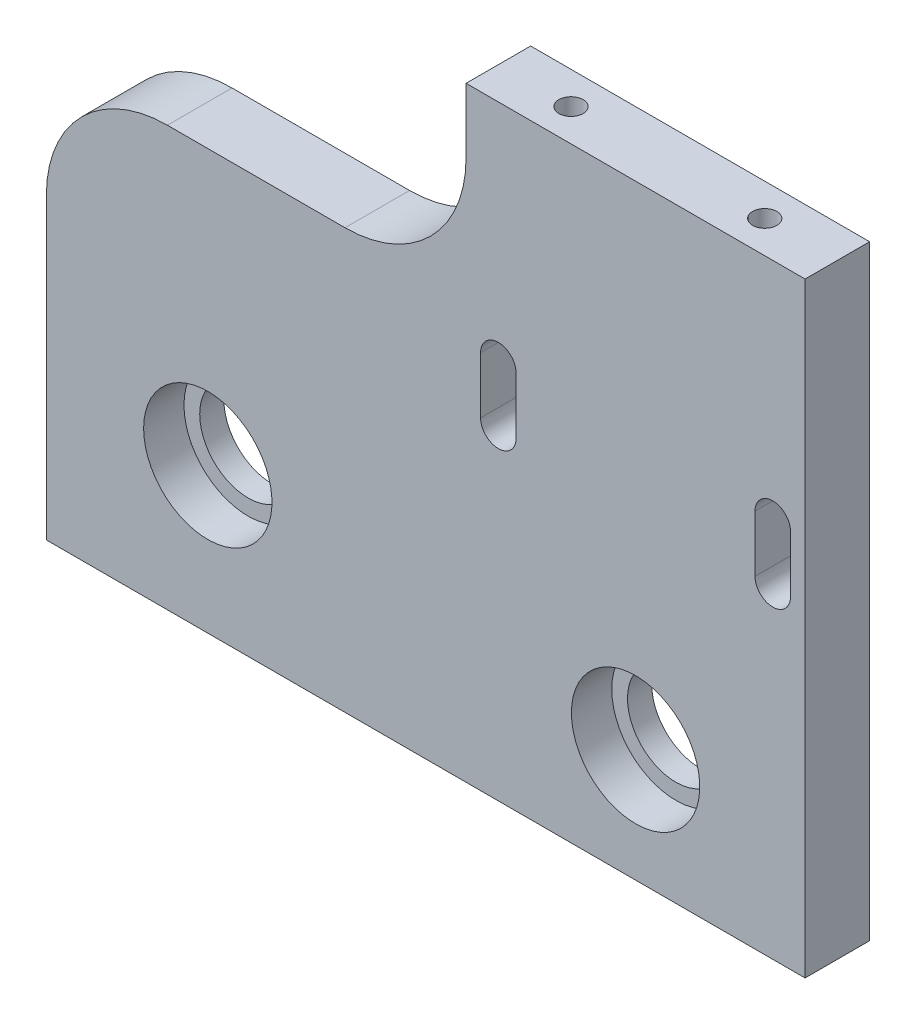
ISO-10303-21;
HEADER;
FILE_DESCRIPTION(('STEP AP214'),'2;1');
FILE_NAME('part.step','',(''),(''),'','','');
FILE_SCHEMA(('AUTOMOTIVE_DESIGN { 1 0 10303 214 1 1 1 1 }'));
ENDSEC;
DATA;
#1=APPLICATION_CONTEXT('core data for automotive mechanical design processes');
#2=APPLICATION_PROTOCOL_DEFINITION('international standard','automotive_design',2000,#1);
#3=PRODUCT_CONTEXT('',#1,'mechanical');
#4=PRODUCT('Part','Part','',(#3));
#5=PRODUCT_RELATED_PRODUCT_CATEGORY('part','',(#4));
#6=PRODUCT_DEFINITION_FORMATION('','',#4);
#7=PRODUCT_DEFINITION_CONTEXT('part definition',#1,'design');
#8=PRODUCT_DEFINITION('design','',#6,#7);
#9=PRODUCT_DEFINITION_SHAPE('','',#8);
#10=(LENGTH_UNIT() NAMED_UNIT(*) SI_UNIT(.MILLI.,.METRE.));
#11=(NAMED_UNIT(*) PLANE_ANGLE_UNIT() SI_UNIT($,.RADIAN.));
#12=(NAMED_UNIT(*) SI_UNIT($,.STERADIAN.) SOLID_ANGLE_UNIT());
#13=UNCERTAINTY_MEASURE_WITH_UNIT(LENGTH_MEASURE(1.E-05),#10,'distance_accuracy_value','');
#14=(GEOMETRIC_REPRESENTATION_CONTEXT(3) GLOBAL_UNCERTAINTY_ASSIGNED_CONTEXT((#13)) GLOBAL_UNIT_ASSIGNED_CONTEXT((#10,
#11,#12)) REPRESENTATION_CONTEXT('',''));
#15=CARTESIAN_POINT('',(0.,0.,0.));
#16=DIRECTION('',(0.,0.,1.));
#17=DIRECTION('',(1.,0.,0.));
#18=AXIS2_PLACEMENT_3D('',#15,#16,#17);
#19=CARTESIAN_POINT('',(0.,0.,-8.));
#20=DIRECTION('',(1.,0.,0.));
#21=DIRECTION('',(0.,1.,0.));
#22=AXIS2_PLACEMENT_3D('',#19,#20,#21);
#23=PLANE('',#22);
#24=DIRECTION('',(0.,-1.,0.));
#25=VECTOR('',#24,1.);
#26=CARTESIAN_POINT('',(0.,0.,-8.));
#27=LINE('',#26,#25);
#28=CARTESIAN_POINT('',(0.,37.,-8.));
#29=VERTEX_POINT('',#28);
#30=CARTESIAN_POINT('',(0.,0.,-8.));
#31=VERTEX_POINT('',#30);
#32=EDGE_CURVE('E257',#29,#31,#27,.T.);
#33=ORIENTED_EDGE('',*,*,#32,.T.);
#34=DIRECTION('',(0.,0.,1.));
#35=VECTOR('',#34,1.);
#36=CARTESIAN_POINT('',(0.,0.,-8.));
#37=LINE('',#36,#35);
#38=CARTESIAN_POINT('',(0.,0.,0.));
#39=VERTEX_POINT('',#38);
#40=EDGE_CURVE('E301',#31,#39,#37,.T.);
#41=ORIENTED_EDGE('',*,*,#40,.T.);
#42=DIRECTION('',(0.,-1.,0.));
#43=VECTOR('',#42,1.);
#44=CARTESIAN_POINT('',(0.,0.,0.));
#45=LINE('',#44,#43);
#46=CARTESIAN_POINT('',(0.,37.,0.));
#47=VERTEX_POINT('',#46);
#48=EDGE_CURVE('E248',#47,#39,#45,.T.);
#49=ORIENTED_EDGE('',*,*,#48,.F.);
#50=DIRECTION('',(0.,0.,1.));
#51=VECTOR('',#50,1.);
#52=CARTESIAN_POINT('',(0.,37.,-8.));
#53=LINE('',#52,#51);
#54=EDGE_CURVE('E304',#29,#47,#53,.T.);
#55=ORIENTED_EDGE('',*,*,#54,.F.);
#56=EDGE_LOOP('',(#33,#41,#49,#55));
#57=FACE_BOUND('',#56,.T.);
#58=ADVANCED_FACE('F43',(#57),#23,.F.);
#59=CARTESIAN_POINT('',(0.,0.,-8.));
#60=DIRECTION('',(0.,1.,0.));
#61=DIRECTION('',(0.,0.,-1.));
#62=AXIS2_PLACEMENT_3D('',#59,#60,#61);
#63=PLANE('',#62);
#64=CARTESIAN_POINT('',(6.00000000000001,0.,-4.));
#65=DIRECTION('',(0.,1.,0.));
#66=DIRECTION('',(0.,0.,1.));
#67=AXIS2_PLACEMENT_3D('',#64,#65,#66);
#68=CIRCLE('',#67,1.5);
#69=CARTESIAN_POINT('',(6.00000000000001,0.,-2.5));
#70=VERTEX_POINT('',#69);
#71=EDGE_CURVE('E678',#70,#70,#68,.T.);
#72=ORIENTED_EDGE('',*,*,#71,.T.);
#73=EDGE_LOOP('',(#72));
#74=FACE_BOUND('',#73,.T.);
#75=CARTESIAN_POINT('',(88.,0.,-4.));
#76=DIRECTION('',(0.,1.,0.));
#77=DIRECTION('',(0.,0.,1.));
#78=AXIS2_PLACEMENT_3D('',#75,#76,#77);
#79=CIRCLE('',#78,1.5);
#80=CARTESIAN_POINT('',(88.,0.,-2.5));
#81=VERTEX_POINT('',#80);
#82=EDGE_CURVE('E687',#81,#81,#79,.T.);
#83=ORIENTED_EDGE('',*,*,#82,.T.);
#84=EDGE_LOOP('',(#83));
#85=FACE_BOUND('',#84,.T.);
#86=DIRECTION('',(1.,0.,0.));
#87=VECTOR('',#86,1.);
#88=CARTESIAN_POINT('',(0.,0.,0.));
#89=LINE('',#88,#87);
#90=CARTESIAN_POINT('',(94.,0.,0.));
#91=VERTEX_POINT('',#90);
#92=EDGE_CURVE('E279',#39,#91,#89,.T.);
#93=ORIENTED_EDGE('',*,*,#92,.F.);
#94=ORIENTED_EDGE('',*,*,#40,.F.);
#95=DIRECTION('',(1.,0.,0.));
#96=VECTOR('',#95,1.);
#97=CARTESIAN_POINT('',(0.,0.,-8.));
#98=LINE('',#97,#96);
#99=CARTESIAN_POINT('',(94.,0.,-8.));
#100=VERTEX_POINT('',#99);
#101=EDGE_CURVE('E260',#31,#100,#98,.T.);
#102=ORIENTED_EDGE('',*,*,#101,.T.);
#103=DIRECTION('',(0.,0.,1.));
#104=VECTOR('',#103,1.);
#105=CARTESIAN_POINT('',(94.,0.,-8.));
#106=LINE('',#105,#104);
#107=EDGE_CURVE('E298',#100,#91,#106,.T.);
#108=ORIENTED_EDGE('',*,*,#107,.T.);
#109=EDGE_LOOP('',(#93,#94,#102,#108));
#110=FACE_BOUND('',#109,.T.);
#111=ADVANCED_FACE('F333',(#74,#85,#110),#63,.F.);
#112=CARTESIAN_POINT('',(94.,0.,-8.));
#113=DIRECTION('',(-1.,0.,0.));
#114=DIRECTION('',(0.,0.,-1.));
#115=AXIS2_PLACEMENT_3D('',#112,#113,#114);
#116=PLANE('',#115);
#117=DIRECTION('',(0.,1.,0.));
#118=VECTOR('',#117,1.);
#119=CARTESIAN_POINT('',(94.,0.,0.));
#120=LINE('',#119,#118);
#121=CARTESIAN_POINT('',(94.,75.,0.));
#122=VERTEX_POINT('',#121);
#123=EDGE_CURVE('E282',#91,#122,#120,.T.);
#124=ORIENTED_EDGE('',*,*,#123,.F.);
#125=ORIENTED_EDGE('',*,*,#107,.F.);
#126=DIRECTION('',(0.,1.,0.));
#127=VECTOR('',#126,1.);
#128=CARTESIAN_POINT('',(94.,0.,-8.));
#129=LINE('',#128,#127);
#130=CARTESIAN_POINT('',(94.,75.,-8.));
#131=VERTEX_POINT('',#130);
#132=EDGE_CURVE('E264',#100,#131,#129,.T.);
#133=ORIENTED_EDGE('',*,*,#132,.T.);
#134=DIRECTION('',(0.,0.,1.));
#135=VECTOR('',#134,1.);
#136=CARTESIAN_POINT('',(94.,75.,-8.));
#137=LINE('',#136,#135);
#138=EDGE_CURVE('E295',#131,#122,#137,.T.);
#139=ORIENTED_EDGE('',*,*,#138,.T.);
#140=EDGE_LOOP('',(#124,#125,#133,#139));
#141=FACE_BOUND('',#140,.T.);
#142=ADVANCED_FACE('F329',(#141),#116,.F.);
#143=CARTESIAN_POINT('',(52.,75.,-8.));
#144=DIRECTION('',(0.,-1.,0.));
#145=DIRECTION('',(0.,0.,1.));
#146=AXIS2_PLACEMENT_3D('',#143,#144,#145);
#147=PLANE('',#146);
#148=CARTESIAN_POINT('',(61.,75.,-4.));
#149=DIRECTION('',(0.,-1.,0.));
#150=DIRECTION('',(0.,0.,-1.));
#151=AXIS2_PLACEMENT_3D('',#148,#149,#150);
#152=CIRCLE('',#151,1.5);
#153=CARTESIAN_POINT('',(61.,75.,-5.5));
#154=VERTEX_POINT('',#153);
#155=EDGE_CURVE('E670',#154,#154,#152,.T.);
#156=ORIENTED_EDGE('',*,*,#155,.T.);
#157=EDGE_LOOP('',(#156));
#158=FACE_BOUND('',#157,.T.);
#159=CARTESIAN_POINT('',(85.,75.,-4.));
#160=DIRECTION('',(0.,-1.,0.));
#161=DIRECTION('',(0.,0.,-1.));
#162=AXIS2_PLACEMENT_3D('',#159,#160,#161);
#163=CIRCLE('',#162,1.5);
#164=CARTESIAN_POINT('',(85.,75.,-5.5));
#165=VERTEX_POINT('',#164);
#166=EDGE_CURVE('E185',#165,#165,#163,.T.);
#167=ORIENTED_EDGE('',*,*,#166,.T.);
#168=EDGE_LOOP('',(#167));
#169=FACE_BOUND('',#168,.T.);
#170=DIRECTION('',(-1.,0.,0.));
#171=VECTOR('',#170,1.);
#172=CARTESIAN_POINT('',(52.,75.,0.));
#173=LINE('',#172,#171);
#174=CARTESIAN_POINT('',(52.,75.,0.));
#175=VERTEX_POINT('',#174);
#176=EDGE_CURVE('E285',#122,#175,#173,.T.);
#177=ORIENTED_EDGE('',*,*,#176,.F.);
#178=ORIENTED_EDGE('',*,*,#138,.F.);
#179=DIRECTION('',(-1.,0.,0.));
#180=VECTOR('',#179,1.);
#181=CARTESIAN_POINT('',(52.,75.,-8.));
#182=LINE('',#181,#180);
#183=CARTESIAN_POINT('',(52.,75.,-8.));
#184=VERTEX_POINT('',#183);
#185=EDGE_CURVE('E267',#131,#184,#182,.T.);
#186=ORIENTED_EDGE('',*,*,#185,.T.);
#187=DIRECTION('',(0.,0.,1.));
#188=VECTOR('',#187,1.);
#189=CARTESIAN_POINT('',(52.,75.,-8.));
#190=LINE('',#189,#188);
#191=EDGE_CURVE('E276',#184,#175,#190,.T.);
#192=ORIENTED_EDGE('',*,*,#191,.T.);
#193=EDGE_LOOP('',(#177,#178,#186,#192));
#194=FACE_BOUND('',#193,.T.);
#195=ADVANCED_FACE('F327',(#158,#169,#194),#147,.F.);
#196=CARTESIAN_POINT('',(52.,75.,-8.));
#197=DIRECTION('',(1.,0.,0.));
#198=DIRECTION('',(0.,0.,1.));
#199=AXIS2_PLACEMENT_3D('',#196,#197,#198);
#200=PLANE('',#199);
#201=DIRECTION('',(0.,-1.,0.));
#202=VECTOR('',#201,1.);
#203=CARTESIAN_POINT('',(52.,75.,0.));
#204=LINE('',#203,#202);
#205=CARTESIAN_POINT('',(52.,67.,0.));
#206=VERTEX_POINT('',#205);
#207=EDGE_CURVE('E288',#175,#206,#204,.T.);
#208=ORIENTED_EDGE('',*,*,#207,.F.);
#209=ORIENTED_EDGE('',*,*,#191,.F.);
#210=DIRECTION('',(0.,-1.,0.));
#211=VECTOR('',#210,1.);
#212=CARTESIAN_POINT('',(52.,75.,-8.));
#213=LINE('',#212,#211);
#214=CARTESIAN_POINT('',(52.,67.,-8.));
#215=VERTEX_POINT('',#214);
#216=EDGE_CURVE('E270',#184,#215,#213,.T.);
#217=ORIENTED_EDGE('',*,*,#216,.T.);
#218=DIRECTION('',(0.,0.,1.));
#219=VECTOR('',#218,1.);
#220=CARTESIAN_POINT('',(52.,67.,-8.));
#221=LINE('',#220,#219);
#222=EDGE_CURVE('E315',#206,#215,#221,.F.);
#223=ORIENTED_EDGE('',*,*,#222,.F.);
#224=EDGE_LOOP('',(#208,#209,#217,#223));
#225=FACE_BOUND('',#224,.T.);
#226=ADVANCED_FACE('F322',(#225),#200,.F.);
#227=CARTESIAN_POINT('',(52.,52.,-8.));
#228=DIRECTION('',(0.,-1.,0.));
#229=DIRECTION('',(1.,0.,0.));
#230=AXIS2_PLACEMENT_3D('',#227,#228,#229);
#231=PLANE('',#230);
#232=DIRECTION('',(-1.,0.,0.));
#233=VECTOR('',#232,1.);
#234=CARTESIAN_POINT('',(52.,52.,0.));
#235=LINE('',#234,#233);
#236=CARTESIAN_POINT('',(37.,52.,0.));
#237=VERTEX_POINT('',#236);
#238=CARTESIAN_POINT('',(15.,52.,0.));
#239=VERTEX_POINT('',#238);
#240=EDGE_CURVE('E261',#237,#239,#235,.T.);
#241=ORIENTED_EDGE('',*,*,#240,.F.);
#242=DIRECTION('',(0.,0.,1.));
#243=VECTOR('',#242,1.);
#244=CARTESIAN_POINT('',(37.,52.,0.));
#245=LINE('',#244,#243);
#246=CARTESIAN_POINT('',(37.,52.,-8.));
#247=VERTEX_POINT('',#246);
#248=EDGE_CURVE('E309',#247,#237,#245,.T.);
#249=ORIENTED_EDGE('',*,*,#248,.F.);
#250=DIRECTION('',(-1.,0.,0.));
#251=VECTOR('',#250,1.);
#252=CARTESIAN_POINT('',(52.,52.,-8.));
#253=LINE('',#252,#251);
#254=CARTESIAN_POINT('',(15.,52.,-8.));
#255=VERTEX_POINT('',#254);
#256=EDGE_CURVE('E273',#247,#255,#253,.T.);
#257=ORIENTED_EDGE('',*,*,#256,.T.);
#258=DIRECTION('',(0.,0.,1.));
#259=VECTOR('',#258,1.);
#260=CARTESIAN_POINT('',(15.,52.,-8.));
#261=LINE('',#260,#259);
#262=EDGE_CURVE('E312',#239,#255,#261,.F.);
#263=ORIENTED_EDGE('',*,*,#262,.F.);
#264=EDGE_LOOP('',(#241,#249,#257,#263));
#265=FACE_BOUND('',#264,.T.);
#266=ADVANCED_FACE('F341',(#265),#231,.F.);
#267=CARTESIAN_POINT('',(0.,0.,-8.));
#268=DIRECTION('',(0.,0.,-1.));
#269=DIRECTION('',(1.,0.,0.));
#270=AXIS2_PLACEMENT_3D('',#267,#268,#269);
#271=PLANE('',#270);
#272=CARTESIAN_POINT('',(90.,40.,-8.));
#273=DIRECTION('',(0.,0.,-1.));
#274=DIRECTION('',(-1.,0.,0.));
#275=AXIS2_PLACEMENT_3D('',#272,#273,#274);
#276=CIRCLE('',#275,2.19999999999999);
#277=CARTESIAN_POINT('',(92.2,40.,-8.));
#278=VERTEX_POINT('',#277);
#279=CARTESIAN_POINT('',(87.8,40.,-8.));
#280=VERTEX_POINT('',#279);
#281=EDGE_CURVE('E172',#278,#280,#276,.T.);
#282=ORIENTED_EDGE('',*,*,#281,.F.);
#283=DIRECTION('',(0.,-1.,0.));
#284=VECTOR('',#283,1.);
#285=CARTESIAN_POINT('',(92.2,40.,-8.));
#286=LINE('',#285,#284);
#287=CARTESIAN_POINT('',(92.2,47.,-8.));
#288=VERTEX_POINT('',#287);
#289=EDGE_CURVE('E165',#288,#278,#286,.T.);
#290=ORIENTED_EDGE('',*,*,#289,.F.);
#291=CARTESIAN_POINT('',(90.,47.,-8.));
#292=DIRECTION('',(0.,0.,-1.));
#293=DIRECTION('',(-1.,0.,0.));
#294=AXIS2_PLACEMENT_3D('',#291,#292,#293);
#295=CIRCLE('',#294,2.19999999999999);
#296=CARTESIAN_POINT('',(87.8,47.,-8.));
#297=VERTEX_POINT('',#296);
#298=EDGE_CURVE('E174',#297,#288,#295,.T.);
#299=ORIENTED_EDGE('',*,*,#298,.F.);
#300=DIRECTION('',(0.,1.,0.));
#301=VECTOR('',#300,1.);
#302=CARTESIAN_POINT('',(87.8,40.,-8.));
#303=LINE('',#302,#301);
#304=EDGE_CURVE('E156',#280,#297,#303,.T.);
#305=ORIENTED_EDGE('',*,*,#304,.F.);
#306=EDGE_LOOP('',(#282,#290,#299,#305));
#307=FACE_BOUND('',#306,.T.);
#308=CARTESIAN_POINT('',(56.,40.,-8.));
#309=DIRECTION('',(0.,0.,-1.));
#310=DIRECTION('',(1.,0.,0.));
#311=AXIS2_PLACEMENT_3D('',#308,#309,#310);
#312=CIRCLE('',#311,2.19999999999999);
#313=CARTESIAN_POINT('',(58.2,40.,-8.));
#314=VERTEX_POINT('',#313);
#315=CARTESIAN_POINT('',(53.8,40.,-8.));
#316=VERTEX_POINT('',#315);
#317=EDGE_CURVE('E201',#314,#316,#312,.T.);
#318=ORIENTED_EDGE('',*,*,#317,.F.);
#319=DIRECTION('',(0.,-1.,0.));
#320=VECTOR('',#319,1.);
#321=CARTESIAN_POINT('',(58.2,40.,-8.));
#322=LINE('',#321,#320);
#323=CARTESIAN_POINT('',(58.2,47.,-8.));
#324=VERTEX_POINT('',#323);
#325=EDGE_CURVE('E211',#324,#314,#322,.T.);
#326=ORIENTED_EDGE('',*,*,#325,.F.);
#327=CARTESIAN_POINT('',(56.,47.,-8.));
#328=DIRECTION('',(0.,0.,-1.));
#329=DIRECTION('',(1.,0.,0.));
#330=AXIS2_PLACEMENT_3D('',#327,#328,#329);
#331=CIRCLE('',#330,2.19999999999999);
#332=CARTESIAN_POINT('',(53.8,47.,-8.));
#333=VERTEX_POINT('',#332);
#334=EDGE_CURVE('E208',#333,#324,#331,.T.);
#335=ORIENTED_EDGE('',*,*,#334,.F.);
#336=DIRECTION('',(0.,1.,0.));
#337=VECTOR('',#336,1.);
#338=CARTESIAN_POINT('',(53.8,40.,-8.));
#339=LINE('',#338,#337);
#340=EDGE_CURVE('E204',#316,#333,#339,.T.);
#341=ORIENTED_EDGE('',*,*,#340,.F.);
#342=EDGE_LOOP('',(#318,#326,#335,#341));
#343=FACE_BOUND('',#342,.T.);
#344=CARTESIAN_POINT('',(73.,14.,-8.));
#345=DIRECTION('',(0.,0.,-1.));
#346=DIRECTION('',(-1.,0.,0.));
#347=AXIS2_PLACEMENT_3D('',#344,#345,#346);
#348=CIRCLE('',#347,6.);
#349=CARTESIAN_POINT('',(67.,14.,-8.));
#350=VERTEX_POINT('',#349);
#351=EDGE_CURVE('E233',#350,#350,#348,.T.);
#352=ORIENTED_EDGE('',*,*,#351,.F.);
#353=EDGE_LOOP('',(#352));
#354=FACE_BOUND('',#353,.T.);
#355=CARTESIAN_POINT('',(20.,18.,-8.));
#356=DIRECTION('',(0.,0.,-1.));
#357=DIRECTION('',(-1.,0.,0.));
#358=AXIS2_PLACEMENT_3D('',#355,#356,#357);
#359=CIRCLE('',#358,6.);
#360=CARTESIAN_POINT('',(14.,18.,-8.));
#361=VERTEX_POINT('',#360);
#362=EDGE_CURVE('E240',#361,#361,#359,.T.);
#363=ORIENTED_EDGE('',*,*,#362,.F.);
#364=EDGE_LOOP('',(#363));
#365=FACE_BOUND('',#364,.T.);
#366=ORIENTED_EDGE('',*,*,#256,.F.);
#367=CARTESIAN_POINT('',(37.,67.,-8.));
#368=DIRECTION('',(0.,0.,1.));
#369=DIRECTION('',(1.,0.,0.));
#370=AXIS2_PLACEMENT_3D('',#367,#368,#369);
#371=CIRCLE('',#370,15.);
#372=EDGE_CURVE('E11',#215,#247,#371,.F.);
#373=ORIENTED_EDGE('',*,*,#372,.F.);
#374=ORIENTED_EDGE('',*,*,#216,.F.);
#375=ORIENTED_EDGE('',*,*,#185,.F.);
#376=ORIENTED_EDGE('',*,*,#132,.F.);
#377=ORIENTED_EDGE('',*,*,#101,.F.);
#378=ORIENTED_EDGE('',*,*,#32,.F.);
#379=CARTESIAN_POINT('',(15.,37.,-8.));
#380=DIRECTION('',(0.,0.,1.));
#381=DIRECTION('',(1.,0.,0.));
#382=AXIS2_PLACEMENT_3D('',#379,#380,#381);
#383=CIRCLE('',#382,15.);
#384=EDGE_CURVE('E62',#255,#29,#383,.T.);
#385=ORIENTED_EDGE('',*,*,#384,.F.);
#386=EDGE_LOOP('',(#366,#373,#374,#375,#376,#377,#378,#385));
#387=FACE_BOUND('',#386,.T.);
#388=ADVANCED_FACE('F169',(#307,#343,#354,#365,#387),#271,.T.);
#389=CARTESIAN_POINT('',(0.,0.,0.));
#390=DIRECTION('',(0.,0.,-1.));
#391=DIRECTION('',(1.,0.,0.));
#392=AXIS2_PLACEMENT_3D('',#389,#390,#391);
#393=PLANE('',#392);
#394=DIRECTION('',(0.,1.,0.));
#395=VECTOR('',#394,1.);
#396=CARTESIAN_POINT('',(87.8,40.,0.));
#397=LINE('',#396,#395);
#398=CARTESIAN_POINT('',(87.8,40.,0.));
#399=VERTEX_POINT('',#398);
#400=CARTESIAN_POINT('',(87.8,47.,0.));
#401=VERTEX_POINT('',#400);
#402=EDGE_CURVE('E159',#399,#401,#397,.T.);
#403=ORIENTED_EDGE('',*,*,#402,.T.);
#404=CARTESIAN_POINT('',(90.,47.,0.));
#405=DIRECTION('',(0.,0.,-1.));
#406=DIRECTION('',(-1.,0.,0.));
#407=AXIS2_PLACEMENT_3D('',#404,#405,#406);
#408=CIRCLE('',#407,2.19999999999999);
#409=CARTESIAN_POINT('',(92.2,47.,0.));
#410=VERTEX_POINT('',#409);
#411=EDGE_CURVE('E182',#401,#410,#408,.T.);
#412=ORIENTED_EDGE('',*,*,#411,.T.);
#413=DIRECTION('',(0.,-1.,0.));
#414=VECTOR('',#413,1.);
#415=CARTESIAN_POINT('',(92.2,40.,0.));
#416=LINE('',#415,#414);
#417=CARTESIAN_POINT('',(92.2,40.,0.));
#418=VERTEX_POINT('',#417);
#419=EDGE_CURVE('E179',#410,#418,#416,.T.);
#420=ORIENTED_EDGE('',*,*,#419,.T.);
#421=CARTESIAN_POINT('',(90.,40.,0.));
#422=DIRECTION('',(0.,0.,-1.));
#423=DIRECTION('',(-1.,0.,0.));
#424=AXIS2_PLACEMENT_3D('',#421,#422,#423);
#425=CIRCLE('',#424,2.19999999999999);
#426=EDGE_CURVE('E190',#418,#399,#425,.T.);
#427=ORIENTED_EDGE('',*,*,#426,.T.);
#428=EDGE_LOOP('',(#403,#412,#420,#427));
#429=FACE_BOUND('',#428,.T.);
#430=DIRECTION('',(0.,1.,0.));
#431=VECTOR('',#430,1.);
#432=CARTESIAN_POINT('',(53.8,40.,0.));
#433=LINE('',#432,#431);
#434=CARTESIAN_POINT('',(53.8,40.,0.));
#435=VERTEX_POINT('',#434);
#436=CARTESIAN_POINT('',(53.8,47.,0.));
#437=VERTEX_POINT('',#436);
#438=EDGE_CURVE('E218',#435,#437,#433,.T.);
#439=ORIENTED_EDGE('',*,*,#438,.T.);
#440=CARTESIAN_POINT('',(56.,47.,0.));
#441=DIRECTION('',(0.,0.,-1.));
#442=DIRECTION('',(1.,0.,0.));
#443=AXIS2_PLACEMENT_3D('',#440,#441,#442);
#444=CIRCLE('',#443,2.19999999999999);
#445=CARTESIAN_POINT('',(58.2,47.,0.));
#446=VERTEX_POINT('',#445);
#447=EDGE_CURVE('E222',#437,#446,#444,.T.);
#448=ORIENTED_EDGE('',*,*,#447,.T.);
#449=DIRECTION('',(0.,-1.,0.));
#450=VECTOR('',#449,1.);
#451=CARTESIAN_POINT('',(58.2,40.,0.));
#452=LINE('',#451,#450);
#453=CARTESIAN_POINT('',(58.2,40.,0.));
#454=VERTEX_POINT('',#453);
#455=EDGE_CURVE('E205',#446,#454,#452,.T.);
#456=ORIENTED_EDGE('',*,*,#455,.T.);
#457=CARTESIAN_POINT('',(56.,40.,0.));
#458=DIRECTION('',(0.,0.,-1.));
#459=DIRECTION('',(1.,0.,0.));
#460=AXIS2_PLACEMENT_3D('',#457,#458,#459);
#461=CIRCLE('',#460,2.19999999999999);
#462=EDGE_CURVE('E215',#454,#435,#461,.T.);
#463=ORIENTED_EDGE('',*,*,#462,.T.);
#464=EDGE_LOOP('',(#439,#448,#456,#463));
#465=FACE_BOUND('',#464,.T.);
#466=CARTESIAN_POINT('',(20.,18.,0.));
#467=DIRECTION('',(0.,0.,-1.));
#468=DIRECTION('',(-1.,0.,0.));
#469=AXIS2_PLACEMENT_3D('',#466,#467,#468);
#470=CIRCLE('',#469,7.95);
#471=CARTESIAN_POINT('',(12.05,18.,0.));
#472=VERTEX_POINT('',#471);
#473=EDGE_CURVE('E249',#472,#472,#470,.T.);
#474=ORIENTED_EDGE('',*,*,#473,.T.);
#475=EDGE_LOOP('',(#474));
#476=FACE_BOUND('',#475,.T.);
#477=CARTESIAN_POINT('',(73.,14.,0.));
#478=DIRECTION('',(0.,0.,-1.));
#479=DIRECTION('',(-1.,0.,0.));
#480=AXIS2_PLACEMENT_3D('',#477,#478,#479);
#481=CIRCLE('',#480,7.95);
#482=CARTESIAN_POINT('',(65.05,14.,0.));
#483=VERTEX_POINT('',#482);
#484=EDGE_CURVE('E236',#483,#483,#481,.T.);
#485=ORIENTED_EDGE('',*,*,#484,.T.);
#486=EDGE_LOOP('',(#485));
#487=FACE_BOUND('',#486,.T.);
#488=ORIENTED_EDGE('',*,*,#48,.T.);
#489=ORIENTED_EDGE('',*,*,#92,.T.);
#490=ORIENTED_EDGE('',*,*,#123,.T.);
#491=ORIENTED_EDGE('',*,*,#176,.T.);
#492=ORIENTED_EDGE('',*,*,#207,.T.);
#493=CARTESIAN_POINT('',(37.,67.,0.));
#494=DIRECTION('',(0.,0.,1.));
#495=DIRECTION('',(1.,0.,0.));
#496=AXIS2_PLACEMENT_3D('',#493,#494,#495);
#497=CIRCLE('',#496,15.);
#498=EDGE_CURVE('E51',#237,#206,#497,.T.);
#499=ORIENTED_EDGE('',*,*,#498,.F.);
#500=ORIENTED_EDGE('',*,*,#240,.T.);
#501=CARTESIAN_POINT('',(15.,37.,0.));
#502=DIRECTION('',(0.,0.,1.));
#503=DIRECTION('',(1.,0.,0.));
#504=AXIS2_PLACEMENT_3D('',#501,#502,#503);
#505=CIRCLE('',#504,15.);
#506=EDGE_CURVE('E307',#47,#239,#505,.F.);
#507=ORIENTED_EDGE('',*,*,#506,.F.);
#508=EDGE_LOOP('',(#488,#489,#490,#491,#492,#499,#500,#507));
#509=FACE_BOUND('',#508,.T.);
#510=ADVANCED_FACE('F324',(#429,#465,#476,#487,#509),#393,.F.);
#511=CARTESIAN_POINT('',(73.,14.,-5.));
#512=DIRECTION('',(0.,0.,1.));
#513=DIRECTION('',(-1.,0.,0.));
#514=AXIS2_PLACEMENT_3D('',#511,#512,#513);
#515=CYLINDRICAL_SURFACE('',#514,7.95);
#516=CARTESIAN_POINT('',(73.,14.,-5.));
#517=DIRECTION('',(0.,0.,-1.));
#518=DIRECTION('',(-1.,0.,0.));
#519=AXIS2_PLACEMENT_3D('',#516,#517,#518);
#520=CIRCLE('',#519,7.95);
#521=CARTESIAN_POINT('',(65.05,14.,-5.));
#522=VERTEX_POINT('',#521);
#523=EDGE_CURVE('E252',#522,#522,#520,.T.);
#524=ORIENTED_EDGE('',*,*,#523,.T.);
#525=EDGE_LOOP('',(#524));
#526=FACE_BOUND('',#525,.T.);
#527=ORIENTED_EDGE('',*,*,#484,.F.);
#528=EDGE_LOOP('',(#527));
#529=FACE_BOUND('',#528,.T.);
#530=ADVANCED_FACE('F433',(#526,#529),#515,.F.);
#531=CARTESIAN_POINT('',(73.,14.,-5.));
#532=DIRECTION('',(0.,0.,1.));
#533=DIRECTION('',(-1.,0.,0.));
#534=AXIS2_PLACEMENT_3D('',#531,#532,#533);
#535=PLANE('',#534);
#536=CARTESIAN_POINT('',(73.,14.,-5.));
#537=DIRECTION('',(0.,0.,-1.));
#538=DIRECTION('',(-1.,0.,0.));
#539=AXIS2_PLACEMENT_3D('',#536,#537,#538);
#540=CIRCLE('',#539,6.);
#541=CARTESIAN_POINT('',(67.,14.,-5.));
#542=VERTEX_POINT('',#541);
#543=EDGE_CURVE('E237',#542,#542,#540,.T.);
#544=ORIENTED_EDGE('',*,*,#543,.T.);
#545=EDGE_LOOP('',(#544));
#546=FACE_BOUND('',#545,.T.);
#547=ORIENTED_EDGE('',*,*,#523,.F.);
#548=EDGE_LOOP('',(#547));
#549=FACE_BOUND('',#548,.T.);
#550=ADVANCED_FACE('F429',(#546,#549),#535,.T.);
#551=CARTESIAN_POINT('',(20.,18.,-5.));
#552=DIRECTION('',(0.,0.,1.));
#553=DIRECTION('',(-1.,0.,0.));
#554=AXIS2_PLACEMENT_3D('',#551,#552,#553);
#555=CYLINDRICAL_SURFACE('',#554,7.95);
#556=CARTESIAN_POINT('',(20.,18.,-5.));
#557=DIRECTION('',(0.,0.,-1.));
#558=DIRECTION('',(-1.,0.,0.));
#559=AXIS2_PLACEMENT_3D('',#556,#557,#558);
#560=CIRCLE('',#559,7.95);
#561=CARTESIAN_POINT('',(12.05,18.,-5.));
#562=VERTEX_POINT('',#561);
#563=EDGE_CURVE('E245',#562,#562,#560,.T.);
#564=ORIENTED_EDGE('',*,*,#563,.T.);
#565=EDGE_LOOP('',(#564));
#566=FACE_BOUND('',#565,.T.);
#567=ORIENTED_EDGE('',*,*,#473,.F.);
#568=EDGE_LOOP('',(#567));
#569=FACE_BOUND('',#568,.T.);
#570=ADVANCED_FACE('F425',(#566,#569),#555,.F.);
#571=CARTESIAN_POINT('',(20.,18.,-5.));
#572=DIRECTION('',(0.,0.,1.));
#573=DIRECTION('',(-1.,0.,0.));
#574=AXIS2_PLACEMENT_3D('',#571,#572,#573);
#575=PLANE('',#574);
#576=CARTESIAN_POINT('',(20.,18.,-5.));
#577=DIRECTION('',(0.,0.,-1.));
#578=DIRECTION('',(-1.,0.,0.));
#579=AXIS2_PLACEMENT_3D('',#576,#577,#578);
#580=CIRCLE('',#579,6.);
#581=CARTESIAN_POINT('',(14.,18.,-5.));
#582=VERTEX_POINT('',#581);
#583=EDGE_CURVE('E197',#582,#582,#580,.T.);
#584=ORIENTED_EDGE('',*,*,#583,.T.);
#585=EDGE_LOOP('',(#584));
#586=FACE_BOUND('',#585,.T.);
#587=ORIENTED_EDGE('',*,*,#563,.F.);
#588=EDGE_LOOP('',(#587));
#589=FACE_BOUND('',#588,.T.);
#590=ADVANCED_FACE('F421',(#586,#589),#575,.T.);
#591=CARTESIAN_POINT('',(20.,18.,-8.));
#592=DIRECTION('',(0.,0.,1.));
#593=DIRECTION('',(-1.,0.,0.));
#594=AXIS2_PLACEMENT_3D('',#591,#592,#593);
#595=CYLINDRICAL_SURFACE('',#594,6.);
#596=ORIENTED_EDGE('',*,*,#362,.T.);
#597=EDGE_LOOP('',(#596));
#598=FACE_BOUND('',#597,.T.);
#599=ORIENTED_EDGE('',*,*,#583,.F.);
#600=EDGE_LOOP('',(#599));
#601=FACE_BOUND('',#600,.T.);
#602=ADVANCED_FACE('F417',(#598,#601),#595,.F.);
#603=CARTESIAN_POINT('',(73.,14.,-8.));
#604=DIRECTION('',(0.,0.,1.));
#605=DIRECTION('',(-1.,0.,0.));
#606=AXIS2_PLACEMENT_3D('',#603,#604,#605);
#607=CYLINDRICAL_SURFACE('',#606,6.);
#608=ORIENTED_EDGE('',*,*,#351,.T.);
#609=EDGE_LOOP('',(#608));
#610=FACE_BOUND('',#609,.T.);
#611=ORIENTED_EDGE('',*,*,#543,.F.);
#612=EDGE_LOOP('',(#611));
#613=FACE_BOUND('',#612,.T.);
#614=ADVANCED_FACE('F413',(#610,#613),#607,.F.);
#615=CARTESIAN_POINT('',(56.,40.,-8.));
#616=DIRECTION('',(0.,0.,1.));
#617=DIRECTION('',(-1.,0.,0.));
#618=AXIS2_PLACEMENT_3D('',#615,#616,#617);
#619=CYLINDRICAL_SURFACE('',#618,2.19999999999999);
#620=ORIENTED_EDGE('',*,*,#462,.F.);
#621=DIRECTION('',(0.,0.,1.));
#622=VECTOR('',#621,1.);
#623=CARTESIAN_POINT('',(58.2,40.,-8.));
#624=LINE('',#623,#622);
#625=EDGE_CURVE('E192',#314,#454,#624,.T.);
#626=ORIENTED_EDGE('',*,*,#625,.F.);
#627=ORIENTED_EDGE('',*,*,#317,.T.);
#628=DIRECTION('',(0.,0.,1.));
#629=VECTOR('',#628,1.);
#630=CARTESIAN_POINT('',(53.8,40.,-8.));
#631=LINE('',#630,#629);
#632=EDGE_CURVE('E214',#316,#435,#631,.T.);
#633=ORIENTED_EDGE('',*,*,#632,.T.);
#634=EDGE_LOOP('',(#620,#626,#627,#633));
#635=FACE_BOUND('',#634,.T.);
#636=ADVANCED_FACE('F403',(#635),#619,.F.);
#637=CARTESIAN_POINT('',(58.2,40.,-8.));
#638=DIRECTION('',(1.,0.,0.));
#639=DIRECTION('',(0.,0.,1.));
#640=AXIS2_PLACEMENT_3D('',#637,#638,#639);
#641=PLANE('',#640);
#642=ORIENTED_EDGE('',*,*,#455,.F.);
#643=DIRECTION('',(0.,0.,1.));
#644=VECTOR('',#643,1.);
#645=CARTESIAN_POINT('',(58.2,47.,-8.));
#646=LINE('',#645,#644);
#647=EDGE_CURVE('E228',#324,#446,#646,.T.);
#648=ORIENTED_EDGE('',*,*,#647,.F.);
#649=ORIENTED_EDGE('',*,*,#325,.T.);
#650=ORIENTED_EDGE('',*,*,#625,.T.);
#651=EDGE_LOOP('',(#642,#648,#649,#650));
#652=FACE_BOUND('',#651,.T.);
#653=ADVANCED_FACE('F399',(#652),#641,.F.);
#654=CARTESIAN_POINT('',(56.,47.,-8.));
#655=DIRECTION('',(0.,0.,1.));
#656=DIRECTION('',(-1.,0.,0.));
#657=AXIS2_PLACEMENT_3D('',#654,#655,#656);
#658=CYLINDRICAL_SURFACE('',#657,2.19999999999999);
#659=ORIENTED_EDGE('',*,*,#447,.F.);
#660=DIRECTION('',(0.,0.,1.));
#661=VECTOR('',#660,1.);
#662=CARTESIAN_POINT('',(53.8,47.,-8.));
#663=LINE('',#662,#661);
#664=EDGE_CURVE('E230',#333,#437,#663,.T.);
#665=ORIENTED_EDGE('',*,*,#664,.F.);
#666=ORIENTED_EDGE('',*,*,#334,.T.);
#667=ORIENTED_EDGE('',*,*,#647,.T.);
#668=EDGE_LOOP('',(#659,#665,#666,#667));
#669=FACE_BOUND('',#668,.T.);
#670=ADVANCED_FACE('F402',(#669),#658,.F.);
#671=CARTESIAN_POINT('',(53.8,40.,-8.));
#672=DIRECTION('',(-1.,0.,0.));
#673=DIRECTION('',(0.,0.,-1.));
#674=AXIS2_PLACEMENT_3D('',#671,#672,#673);
#675=PLANE('',#674);
#676=ORIENTED_EDGE('',*,*,#438,.F.);
#677=ORIENTED_EDGE('',*,*,#632,.F.);
#678=ORIENTED_EDGE('',*,*,#340,.T.);
#679=ORIENTED_EDGE('',*,*,#664,.T.);
#680=EDGE_LOOP('',(#676,#677,#678,#679));
#681=FACE_BOUND('',#680,.T.);
#682=ADVANCED_FACE('F398',(#681),#675,.F.);
#683=CARTESIAN_POINT('',(90.,40.,-8.));
#684=DIRECTION('',(0.,0.,1.));
#685=DIRECTION('',(-1.,0.,0.));
#686=AXIS2_PLACEMENT_3D('',#683,#684,#685);
#687=CYLINDRICAL_SURFACE('',#686,2.19999999999999);
#688=ORIENTED_EDGE('',*,*,#426,.F.);
#689=DIRECTION('',(0.,0.,1.));
#690=VECTOR('',#689,1.);
#691=CARTESIAN_POINT('',(92.2,40.,-8.));
#692=LINE('',#691,#690);
#693=EDGE_CURVE('E177',#278,#418,#692,.T.);
#694=ORIENTED_EDGE('',*,*,#693,.F.);
#695=ORIENTED_EDGE('',*,*,#281,.T.);
#696=DIRECTION('',(0.,0.,1.));
#697=VECTOR('',#696,1.);
#698=CARTESIAN_POINT('',(87.8,40.,-8.));
#699=LINE('',#698,#697);
#700=EDGE_CURVE('E153',#280,#399,#699,.T.);
#701=ORIENTED_EDGE('',*,*,#700,.T.);
#702=EDGE_LOOP('',(#688,#694,#695,#701));
#703=FACE_BOUND('',#702,.T.);
#704=ADVANCED_FACE('F176',(#703),#687,.F.);
#705=CARTESIAN_POINT('',(92.2,40.,-8.));
#706=DIRECTION('',(1.,0.,0.));
#707=DIRECTION('',(0.,0.,1.));
#708=AXIS2_PLACEMENT_3D('',#705,#706,#707);
#709=PLANE('',#708);
#710=ORIENTED_EDGE('',*,*,#419,.F.);
#711=DIRECTION('',(0.,0.,1.));
#712=VECTOR('',#711,1.);
#713=CARTESIAN_POINT('',(92.2,47.,-8.));
#714=LINE('',#713,#712);
#715=EDGE_CURVE('E198',#288,#410,#714,.T.);
#716=ORIENTED_EDGE('',*,*,#715,.F.);
#717=ORIENTED_EDGE('',*,*,#289,.T.);
#718=ORIENTED_EDGE('',*,*,#693,.T.);
#719=EDGE_LOOP('',(#710,#716,#717,#718));
#720=FACE_BOUND('',#719,.T.);
#721=ADVANCED_FACE('F386',(#720),#709,.F.);
#722=CARTESIAN_POINT('',(90.,47.,-8.));
#723=DIRECTION('',(0.,0.,1.));
#724=DIRECTION('',(-1.,0.,0.));
#725=AXIS2_PLACEMENT_3D('',#722,#723,#724);
#726=CYLINDRICAL_SURFACE('',#725,2.19999999999999);
#727=ORIENTED_EDGE('',*,*,#411,.F.);
#728=DIRECTION('',(0.,0.,1.));
#729=VECTOR('',#728,1.);
#730=CARTESIAN_POINT('',(87.8,47.,-8.));
#731=LINE('',#730,#729);
#732=EDGE_CURVE('E164',#297,#401,#731,.T.);
#733=ORIENTED_EDGE('',*,*,#732,.F.);
#734=ORIENTED_EDGE('',*,*,#298,.T.);
#735=ORIENTED_EDGE('',*,*,#715,.T.);
#736=EDGE_LOOP('',(#727,#733,#734,#735));
#737=FACE_BOUND('',#736,.T.);
#738=ADVANCED_FACE('F389',(#737),#726,.F.);
#739=CARTESIAN_POINT('',(87.8,40.,-8.));
#740=DIRECTION('',(-1.,0.,0.));
#741=DIRECTION('',(0.,0.,-1.));
#742=AXIS2_PLACEMENT_3D('',#739,#740,#741);
#743=PLANE('',#742);
#744=ORIENTED_EDGE('',*,*,#402,.F.);
#745=ORIENTED_EDGE('',*,*,#700,.F.);
#746=ORIENTED_EDGE('',*,*,#304,.T.);
#747=ORIENTED_EDGE('',*,*,#732,.T.);
#748=EDGE_LOOP('',(#744,#745,#746,#747));
#749=FACE_BOUND('',#748,.T.);
#750=ADVANCED_FACE('F155',(#749),#743,.F.);
#751=CARTESIAN_POINT('',(85.,45.,-4.));
#752=DIRECTION('',(0.,1.,0.));
#753=DIRECTION('',(0.,0.,-1.));
#754=AXIS2_PLACEMENT_3D('',#751,#752,#753);
#755=CYLINDRICAL_SURFACE('',#754,1.5);
#756=CARTESIAN_POINT('',(85.,45.,-4.));
#757=DIRECTION('',(0.,-1.,0.));
#758=DIRECTION('',(0.,0.,-1.));
#759=AXIS2_PLACEMENT_3D('',#756,#757,#758);
#760=CIRCLE('',#759,1.5);
#761=CARTESIAN_POINT('',(85.,45.,-5.5));
#762=VERTEX_POINT('',#761);
#763=EDGE_CURVE('E674',#762,#762,#760,.T.);
#764=ORIENTED_EDGE('',*,*,#763,.T.);
#765=EDGE_LOOP('',(#764));
#766=FACE_BOUND('',#765,.T.);
#767=ORIENTED_EDGE('',*,*,#166,.F.);
#768=EDGE_LOOP('',(#767));
#769=FACE_BOUND('',#768,.T.);
#770=ADVANCED_FACE('F381',(#766,#769),#755,.F.);
#771=CARTESIAN_POINT('',(85.,45.,-4.));
#772=DIRECTION('',(0.,1.,0.));
#773=DIRECTION('',(0.,0.,-1.));
#774=AXIS2_PLACEMENT_3D('',#771,#772,#773);
#775=PLANE('',#774);
#776=ORIENTED_EDGE('',*,*,#763,.F.);
#777=EDGE_LOOP('',(#776));
#778=FACE_BOUND('',#777,.T.);
#779=ADVANCED_FACE('F372',(#778),#775,.T.);
#780=CARTESIAN_POINT('',(61.,45.,-4.));
#781=DIRECTION('',(0.,1.,0.));
#782=DIRECTION('',(0.,0.,-1.));
#783=AXIS2_PLACEMENT_3D('',#780,#781,#782);
#784=CYLINDRICAL_SURFACE('',#783,1.5);
#785=CARTESIAN_POINT('',(61.,45.,-4.));
#786=DIRECTION('',(0.,-1.,0.));
#787=DIRECTION('',(0.,0.,-1.));
#788=AXIS2_PLACEMENT_3D('',#785,#786,#787);
#789=CIRCLE('',#788,1.5);
#790=CARTESIAN_POINT('',(61.,45.,-5.5));
#791=VERTEX_POINT('',#790);
#792=EDGE_CURVE('E219',#791,#791,#789,.T.);
#793=ORIENTED_EDGE('',*,*,#792,.T.);
#794=EDGE_LOOP('',(#793));
#795=FACE_BOUND('',#794,.T.);
#796=ORIENTED_EDGE('',*,*,#155,.F.);
#797=EDGE_LOOP('',(#796));
#798=FACE_BOUND('',#797,.T.);
#799=ADVANCED_FACE('F366',(#795,#798),#784,.F.);
#800=CARTESIAN_POINT('',(61.,45.,-4.));
#801=DIRECTION('',(0.,1.,0.));
#802=DIRECTION('',(0.,0.,-1.));
#803=AXIS2_PLACEMENT_3D('',#800,#801,#802);
#804=PLANE('',#803);
#805=ORIENTED_EDGE('',*,*,#792,.F.);
#806=EDGE_LOOP('',(#805));
#807=FACE_BOUND('',#806,.T.);
#808=ADVANCED_FACE('F360',(#807),#804,.T.);
#809=CARTESIAN_POINT('',(15.,37.,-8.));
#810=DIRECTION('',(0.,0.,1.));
#811=DIRECTION('',(-1.,0.,0.));
#812=AXIS2_PLACEMENT_3D('',#809,#810,#811);
#813=CYLINDRICAL_SURFACE('',#812,15.);
#814=ORIENTED_EDGE('',*,*,#384,.T.);
#815=ORIENTED_EDGE('',*,*,#54,.T.);
#816=ORIENTED_EDGE('',*,*,#506,.T.);
#817=ORIENTED_EDGE('',*,*,#262,.T.);
#818=EDGE_LOOP('',(#814,#815,#816,#817));
#819=FACE_BOUND('',#818,.T.);
#820=ADVANCED_FACE('F338',(#819),#813,.T.);
#821=CARTESIAN_POINT('',(37.,67.,-8.));
#822=DIRECTION('',(0.,0.,-1.));
#823=DIRECTION('',(1.,0.,0.));
#824=AXIS2_PLACEMENT_3D('',#821,#822,#823);
#825=CYLINDRICAL_SURFACE('',#824,15.);
#826=ORIENTED_EDGE('',*,*,#372,.T.);
#827=ORIENTED_EDGE('',*,*,#248,.T.);
#828=ORIENTED_EDGE('',*,*,#498,.T.);
#829=ORIENTED_EDGE('',*,*,#222,.T.);
#830=EDGE_LOOP('',(#826,#827,#828,#829));
#831=FACE_BOUND('',#830,.T.);
#832=ADVANCED_FACE('F45',(#831),#825,.F.);
#833=CARTESIAN_POINT('',(88.,20.,-4.));
#834=DIRECTION('',(0.,-1.,0.));
#835=DIRECTION('',(0.,0.,1.));
#836=AXIS2_PLACEMENT_3D('',#833,#834,#835);
#837=CYLINDRICAL_SURFACE('',#836,1.5);
#838=CARTESIAN_POINT('',(88.,20.,-4.));
#839=DIRECTION('',(0.,1.,0.));
#840=DIRECTION('',(0.,0.,1.));
#841=AXIS2_PLACEMENT_3D('',#838,#839,#840);
#842=CIRCLE('',#841,1.5);
#843=CARTESIAN_POINT('',(88.,20.,-2.5));
#844=VERTEX_POINT('',#843);
#845=EDGE_CURVE('E682',#844,#844,#842,.T.);
#846=ORIENTED_EDGE('',*,*,#845,.T.);
#847=EDGE_LOOP('',(#846));
#848=FACE_BOUND('',#847,.T.);
#849=ORIENTED_EDGE('',*,*,#82,.F.);
#850=EDGE_LOOP('',(#849));
#851=FACE_BOUND('',#850,.T.);
#852=ADVANCED_FACE('F365',(#848,#851),#837,.F.);
#853=CARTESIAN_POINT('',(88.,20.,-4.));
#854=DIRECTION('',(0.,-1.,0.));
#855=DIRECTION('',(0.,0.,1.));
#856=AXIS2_PLACEMENT_3D('',#853,#854,#855);
#857=PLANE('',#856);
#858=ORIENTED_EDGE('',*,*,#845,.F.);
#859=EDGE_LOOP('',(#858));
#860=FACE_BOUND('',#859,.T.);
#861=ADVANCED_FACE('F581',(#860),#857,.T.);
#862=CARTESIAN_POINT('',(6.00000000000001,20.,-4.));
#863=DIRECTION('',(0.,-1.,0.));
#864=DIRECTION('',(0.,0.,1.));
#865=AXIS2_PLACEMENT_3D('',#862,#863,#864);
#866=CYLINDRICAL_SURFACE('',#865,1.5);
#867=CARTESIAN_POINT('',(6.00000000000001,20.,-4.));
#868=DIRECTION('',(0.,1.,0.));
#869=DIRECTION('',(0.,0.,1.));
#870=AXIS2_PLACEMENT_3D('',#867,#868,#869);
#871=CIRCLE('',#870,1.5);
#872=CARTESIAN_POINT('',(6.00000000000001,20.,-2.5));
#873=VERTEX_POINT('',#872);
#874=EDGE_CURVE('E675',#873,#873,#871,.T.);
#875=ORIENTED_EDGE('',*,*,#874,.T.);
#876=EDGE_LOOP('',(#875));
#877=FACE_BOUND('',#876,.T.);
#878=ORIENTED_EDGE('',*,*,#71,.F.);
#879=EDGE_LOOP('',(#878));
#880=FACE_BOUND('',#879,.T.);
#881=ADVANCED_FACE('F590',(#877,#880),#866,.F.);
#882=CARTESIAN_POINT('',(6.00000000000001,20.,-4.));
#883=DIRECTION('',(0.,-1.,0.));
#884=DIRECTION('',(0.,0.,1.));
#885=AXIS2_PLACEMENT_3D('',#882,#883,#884);
#886=PLANE('',#885);
#887=ORIENTED_EDGE('',*,*,#874,.F.);
#888=EDGE_LOOP('',(#887));
#889=FACE_BOUND('',#888,.T.);
#890=ADVANCED_FACE('F599',(#889),#886,.T.);
#891=CLOSED_SHELL('',(#58,#111,#142,#195,#226,#266,#388,#510,#530,#550,#570,#590,#602,#614,#636,
#653,#670,#682,#704,#721,#738,#750,#770,#779,#799,#808,#820,#832,#852,#861,#881,#890));
#892=MANIFOLD_SOLID_BREP('B2',#891);
#893=ADVANCED_BREP_SHAPE_REPRESENTATION('',(#18,#892),#14);
#894=SHAPE_DEFINITION_REPRESENTATION(#9,#893);
ENDSEC;
END-ISO-10303-21;
